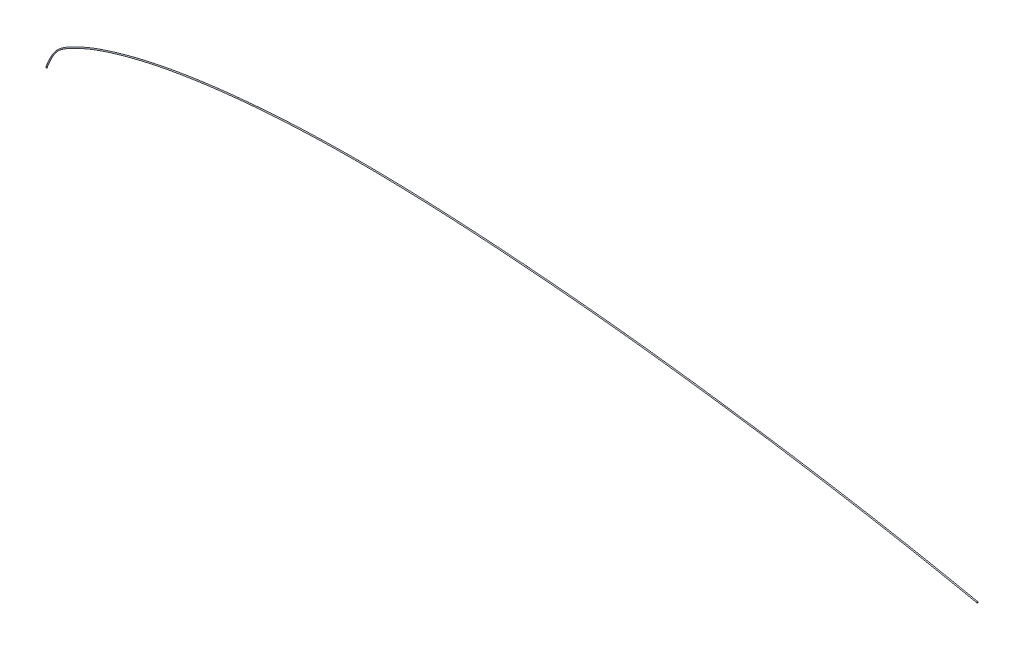
ISO-10303-21;
HEADER;
FILE_DESCRIPTION(('STEP AP214'),'2;1');
FILE_NAME('part.step','',(''),(''),'','','');
FILE_SCHEMA(('AUTOMOTIVE_DESIGN { 1 0 10303 214 1 1 1 1 }'));
ENDSEC;
DATA;
#1=APPLICATION_CONTEXT('core data for automotive mechanical design processes');
#2=APPLICATION_PROTOCOL_DEFINITION('international standard','automotive_design',2000,#1);
#3=PRODUCT_CONTEXT('',#1,'mechanical');
#4=PRODUCT('Part','Part','',(#3));
#5=PRODUCT_RELATED_PRODUCT_CATEGORY('part','',(#4));
#6=PRODUCT_DEFINITION_FORMATION('','',#4);
#7=PRODUCT_DEFINITION_CONTEXT('part definition',#1,'design');
#8=PRODUCT_DEFINITION('design','',#6,#7);
#9=PRODUCT_DEFINITION_SHAPE('','',#8);
#10=(LENGTH_UNIT() NAMED_UNIT(*) SI_UNIT(.MILLI.,.METRE.));
#11=(NAMED_UNIT(*) PLANE_ANGLE_UNIT() SI_UNIT($,.RADIAN.));
#12=(NAMED_UNIT(*) SI_UNIT($,.STERADIAN.) SOLID_ANGLE_UNIT());
#13=UNCERTAINTY_MEASURE_WITH_UNIT(LENGTH_MEASURE(1.E-05),#10,'distance_accuracy_value','');
#14=(GEOMETRIC_REPRESENTATION_CONTEXT(3) GLOBAL_UNCERTAINTY_ASSIGNED_CONTEXT((#13)) GLOBAL_UNIT_ASSIGNED_CONTEXT((#10,
#11,#12)) REPRESENTATION_CONTEXT('',''));
#15=CARTESIAN_POINT('',(0.,0.,0.));
#16=DIRECTION('',(0.,0.,1.));
#17=DIRECTION('',(1.,0.,0.));
#18=AXIS2_PLACEMENT_3D('',#15,#16,#17);
#19=CARTESIAN_POINT('',(821.6356482,1.068126343,0.));
#20=DIRECTION('',(0.981017726503732,0.193918076221502,0.));
#21=DIRECTION('',(0.,0.,1.));
#22=AXIS2_PLACEMENT_3D('',#19,#20,#21);
#23=PLANE('',#22);
#24=CARTESIAN_POINT('',(821.6356482,1.068126343,0.));
#25=DIRECTION('',(0.981017726503732,0.193918076221502,0.));
#26=DIRECTION('',(0.,0.,1.));
#27=AXIS2_PLACEMENT_3D('',#24,#25,#26);
#28=CIRCLE('',#27,0.5);
#29=CARTESIAN_POINT('',(821.6356482,1.068126343,0.5));
#30=VERTEX_POINT('',#29);
#31=EDGE_CURVE('E10',#30,#30,#28,.T.);
#32=ORIENTED_EDGE('',*,*,#31,.T.);
#33=EDGE_LOOP('',(#32));
#34=FACE_BOUND('',#33,.T.);
#35=ADVANCED_FACE('F39',(#34),#23,.T.);
#36=CARTESIAN_POINT('',(821.6356482,1.068126343,0.5));
#37=CARTESIAN_POINT('',(807.949315929663,3.8726429153105,0.5));
#38=CARTESIAN_POINT('',(794.262983662316,6.67715948740843,0.5));
#39=CARTESIAN_POINT('',(739.633161122471,17.3945662259603,0.5));
#40=CARTESIAN_POINT('',(698.520985277327,24.4397528855469,0.5));
#41=CARTESIAN_POINT('',(629.966146484422,35.0385581246609,0.5));
#42=CARTESIAN_POINT('',(602.577080222447,38.959971872981,0.5));
#43=CARTESIAN_POINT('',(547.800671683737,46.1499507530432,0.5));
#44=CARTESIAN_POINT('',(520.413604741873,49.4205662565359,0.5));
#45=CARTESIAN_POINT('',(465.632902318206,55.0828337222342,0.5));
#46=CARTESIAN_POINT('',(438.239542017067,57.4771380091737,0.5));
#47=CARTESIAN_POINT('',(383.4588721508,61.491104774006,0.5));
#48=CARTESIAN_POINT('',(356.071692251463,63.1125277966778,0.5));
#49=CARTESIAN_POINT('',(301.278840028551,65.0611391807135,0.5));
#50=CARTESIAN_POINT('',(273.873260344754,65.3903069812467,0.5));
#51=CARTESIAN_POINT('',(219.050983178815,64.0981242219825,0.5));
#52=CARTESIAN_POINT('',(191.625831459682,62.4953673804491,0.5));
#53=CARTESIAN_POINT('',(150.519756444238,58.2119719363067,0.5));
#54=CARTESIAN_POINT('',(136.746911380907,56.4497204796891,0.5));
#55=CARTESIAN_POINT('',(109.312975276132,52.1023120159522,0.5));
#56=CARTESIAN_POINT('',(95.6523716004522,49.5162650040087,0.5));
#57=CARTESIAN_POINT('',(75.2145134563756,44.5795659214063,0.5));
#58=CARTESIAN_POINT('',(68.3110453118406,42.7226758749477,0.5));
#59=CARTESIAN_POINT('',(54.5715738853773,38.6768513403353,0.5));
#60=CARTESIAN_POINT('',(47.7369220366168,36.48613199558,0.5));
#61=CARTESIAN_POINT('',(36.7868333276846,32.2862239545925,0.5));
#62=CARTESIAN_POINT('',(32.5666487945213,30.4881854096799,0.5));
#63=CARTESIAN_POINT('',(26.304073023569,27.528126593638,0.5));
#64=CARTESIAN_POINT('',(24.2278312714603,26.4976068219342,0.5));
#65=CARTESIAN_POINT('',(20.0905071442538,24.3427443365568,0.5));
#66=CARTESIAN_POINT('',(18.0104542591294,23.2313076901134,0.5));
#67=CARTESIAN_POINT('',(14.0414092535021,20.7837462409737,0.5));
#68=CARTESIAN_POINT('',(12.1591171256037,19.4430632819947,0.5));
#69=CARTESIAN_POINT('',(8.85776861999671,16.3406468875565,0.5));
#70=CARTESIAN_POINT('',(7.44791398536713,14.5716178291864,0.5));
#71=CARTESIAN_POINT('',(3.70331247112468,8.82625416327505,0.5));
#72=CARTESIAN_POINT('',(1.85165623404984,4.41312708300788,0.5));
#73=CARTESIAN_POINT('',(0.,0.,0.5));
#74=CARTESIAN_POINT('',(821.829566276221,0.0871086164962679,0.5));
#75=CARTESIAN_POINT('',(808.143234005109,2.89162518881434,0.5));
#76=CARTESIAN_POINT('',(794.459648892403,5.69667282231044,0.5));
#77=CARTESIAN_POINT('',(739.851664847713,16.4185871723018,0.5));
#78=CARTESIAN_POINT('',(698.751553264622,23.4666318050417,0.5));
#79=CARTESIAN_POINT('',(630.214850913112,34.0699500146192,0.5));
#80=CARTESIAN_POINT('',(602.833163547742,37.9932857265177,0.5));
#81=CARTESIAN_POINT('',(548.071771140847,45.1873680445874,0.5));
#82=CARTESIAN_POINT('',(520.69352836485,48.4604857335446,0.5));
#83=CARTESIAN_POINT('',(465.933037174779,54.1288786757165,0.5));
#84=CARTESIAN_POINT('',(438.54915051956,56.5262278139028,0.5));
#85=CARTESIAN_POINT('',(383.786207048643,60.5461502311617,0.5));
#86=CARTESIAN_POINT('',(356.410871943892,62.1716748057665,0.5));
#87=CARTESIAN_POINT('',(301.647408374213,64.1314059760279,0.5));
#88=CARTESIAN_POINT('',(274.26012686118,64.4678660344989,0.5));
#89=CARTESIAN_POINT('',(219.481209622185,63.195090135347,0.5));
#90=CARTESIAN_POINT('',(192.079130629167,61.6034739262708,0.5));
#91=CARTESIAN_POINT('',(151.013848194414,57.3424218142517,0.5));
#92=CARTESIAN_POINT('',(137.256390445649,55.5890056571223,0.5));
#93=CARTESIAN_POINT('',(109.856416526692,51.2626272355951,0.5));
#94=CARTESIAN_POINT('',(96.2181232764169,48.691016169331,0.5));
#95=CARTESIAN_POINT('',(75.8209381063033,43.7842396370035,0.5));
#96=CARTESIAN_POINT('',(68.9303341859064,41.9373515150608,0.5));
#97=CARTESIAN_POINT('',(55.2155287307647,37.9116224746726,0.5));
#98=CARTESIAN_POINT('',(48.4012159988485,35.7377148490799,0.5));
#99=CARTESIAN_POINT('',(37.4958342417088,31.5805987667842,0.5));
#100=CARTESIAN_POINT('',(33.2933387393552,29.8007404167443,0.5));
#101=CARTESIAN_POINT('',(27.0564967663197,26.8693221955771,0.5));
#102=CARTESIAN_POINT('',(24.9887005302942,25.8485735419041,0.5));
#103=CARTESIAN_POINT('',(20.867856589028,23.7135432015166,0.5));
#104=CARTESIAN_POINT('',(18.7983033095419,22.6138841084808,0.5));
#105=CARTESIAN_POINT('',(14.8802185418365,20.2375622216578,0.5));
#106=CARTESIAN_POINT('',(13.0351612568077,18.952165987822,0.5));
#107=CARTESIAN_POINT('',(9.8085681815603,16.0175158516353,0.5));
#108=CARTESIAN_POINT('',(8.42047072883891,14.3306814336119,0.5));
#109=CARTESIAN_POINT('',(4.7095463844487,8.77002982291899,0.5));
#110=CARTESIAN_POINT('',(2.8516562340514,4.41312708300855,0.5));
#111=CARTESIAN_POINT('',(1.,0.,0.5));
#112=CARTESIAN_POINT('',(821.829566276221,0.0871086164962679,-0.5));
#113=CARTESIAN_POINT('',(808.143234005109,2.89162518881434,-0.5));
#114=CARTESIAN_POINT('',(794.459648892403,5.69667282231044,-0.5));
#115=CARTESIAN_POINT('',(739.851664847713,16.4185871723018,-0.5));
#116=CARTESIAN_POINT('',(698.751553264622,23.4666318050417,-0.5));
#117=CARTESIAN_POINT('',(630.214850913112,34.0699500146192,-0.5));
#118=CARTESIAN_POINT('',(602.833163547742,37.9932857265177,-0.5));
#119=CARTESIAN_POINT('',(548.071771140847,45.1873680445874,-0.5));
#120=CARTESIAN_POINT('',(520.69352836485,48.4604857335446,-0.5));
#121=CARTESIAN_POINT('',(465.933037174779,54.1288786757165,-0.5));
#122=CARTESIAN_POINT('',(438.54915051956,56.5262278139028,-0.5));
#123=CARTESIAN_POINT('',(383.786207048643,60.5461502311617,-0.5));
#124=CARTESIAN_POINT('',(356.410871943892,62.1716748057665,-0.5));
#125=CARTESIAN_POINT('',(301.647408374213,64.1314059760279,-0.5));
#126=CARTESIAN_POINT('',(274.26012686118,64.4678660344989,-0.5));
#127=CARTESIAN_POINT('',(219.481209622185,63.195090135347,-0.5));
#128=CARTESIAN_POINT('',(192.079130629167,61.6034739262708,-0.5));
#129=CARTESIAN_POINT('',(151.013848194414,57.3424218142517,-0.5));
#130=CARTESIAN_POINT('',(137.256390445649,55.5890056571223,-0.5));
#131=CARTESIAN_POINT('',(109.856416526692,51.2626272355951,-0.5));
#132=CARTESIAN_POINT('',(96.2181232764169,48.691016169331,-0.5));
#133=CARTESIAN_POINT('',(75.8209381063033,43.7842396370035,-0.5));
#134=CARTESIAN_POINT('',(68.9303341859064,41.9373515150608,-0.5));
#135=CARTESIAN_POINT('',(55.2155287307647,37.9116224746726,-0.5));
#136=CARTESIAN_POINT('',(48.4012159988485,35.7377148490799,-0.5));
#137=CARTESIAN_POINT('',(37.4958342417088,31.5805987667842,-0.5));
#138=CARTESIAN_POINT('',(33.2933387393552,29.8007404167443,-0.5));
#139=CARTESIAN_POINT('',(27.0564967663197,26.8693221955771,-0.5));
#140=CARTESIAN_POINT('',(24.9887005302942,25.8485735419041,-0.5));
#141=CARTESIAN_POINT('',(20.867856589028,23.7135432015166,-0.5));
#142=CARTESIAN_POINT('',(18.7983033095419,22.6138841084808,-0.5));
#143=CARTESIAN_POINT('',(14.8802185418365,20.2375622216578,-0.5));
#144=CARTESIAN_POINT('',(13.0351612568077,18.952165987822,-0.5));
#145=CARTESIAN_POINT('',(9.8085681815603,16.0175158516353,-0.5));
#146=CARTESIAN_POINT('',(8.42047072883891,14.3306814336119,-0.5));
#147=CARTESIAN_POINT('',(4.7095463844487,8.77002982291899,-0.5));
#148=CARTESIAN_POINT('',(2.8516562340514,4.41312708300855,-0.5));
#149=CARTESIAN_POINT('',(1.,0.,-0.5));
#150=CARTESIAN_POINT('',(821.6356482,1.068126343,-0.5));
#151=CARTESIAN_POINT('',(807.949315929663,3.8726429153105,-0.5));
#152=CARTESIAN_POINT('',(794.262983662316,6.67715948740843,-0.5));
#153=CARTESIAN_POINT('',(739.633161122471,17.3945662259603,-0.5));
#154=CARTESIAN_POINT('',(698.520985277327,24.4397528855469,-0.5));
#155=CARTESIAN_POINT('',(629.966146484422,35.0385581246609,-0.5));
#156=CARTESIAN_POINT('',(602.577080222447,38.959971872981,-0.5));
#157=CARTESIAN_POINT('',(547.800671683737,46.1499507530432,-0.5));
#158=CARTESIAN_POINT('',(520.413604741873,49.4205662565359,-0.5));
#159=CARTESIAN_POINT('',(465.632902318206,55.0828337222342,-0.5));
#160=CARTESIAN_POINT('',(438.239542017067,57.4771380091737,-0.5));
#161=CARTESIAN_POINT('',(383.4588721508,61.491104774006,-0.5));
#162=CARTESIAN_POINT('',(356.071692251463,63.1125277966778,-0.5));
#163=CARTESIAN_POINT('',(301.278840028551,65.0611391807135,-0.5));
#164=CARTESIAN_POINT('',(273.873260344754,65.3903069812467,-0.5));
#165=CARTESIAN_POINT('',(219.050983178815,64.0981242219825,-0.5));
#166=CARTESIAN_POINT('',(191.625831459682,62.4953673804491,-0.5));
#167=CARTESIAN_POINT('',(150.519756444238,58.2119719363067,-0.5));
#168=CARTESIAN_POINT('',(136.746911380907,56.4497204796891,-0.5));
#169=CARTESIAN_POINT('',(109.312975276132,52.1023120159522,-0.5));
#170=CARTESIAN_POINT('',(95.6523716004522,49.5162650040087,-0.5));
#171=CARTESIAN_POINT('',(75.2145134563756,44.5795659214063,-0.5));
#172=CARTESIAN_POINT('',(68.3110453118406,42.7226758749477,-0.5));
#173=CARTESIAN_POINT('',(54.5715738853773,38.6768513403353,-0.5));
#174=CARTESIAN_POINT('',(47.7369220366168,36.48613199558,-0.5));
#175=CARTESIAN_POINT('',(36.7868333276846,32.2862239545925,-0.5));
#176=CARTESIAN_POINT('',(32.5666487945213,30.4881854096799,-0.5));
#177=CARTESIAN_POINT('',(26.304073023569,27.528126593638,-0.5));
#178=CARTESIAN_POINT('',(24.2278312714603,26.4976068219342,-0.5));
#179=CARTESIAN_POINT('',(20.0905071442538,24.3427443365568,-0.5));
#180=CARTESIAN_POINT('',(18.0104542591294,23.2313076901134,-0.5));
#181=CARTESIAN_POINT('',(14.0414092535021,20.7837462409737,-0.5));
#182=CARTESIAN_POINT('',(12.1591171256037,19.4430632819947,-0.5));
#183=CARTESIAN_POINT('',(8.85776861999671,16.3406468875565,-0.5));
#184=CARTESIAN_POINT('',(7.44791398536713,14.5716178291864,-0.5));
#185=CARTESIAN_POINT('',(3.70331247112468,8.82625416327505,-0.5));
#186=CARTESIAN_POINT('',(1.85165623404984,4.41312708300788,-0.5));
#187=CARTESIAN_POINT('',(0.,0.,-0.5));
#188=CARTESIAN_POINT('',(821.441730123778,2.04914406950373,-0.5));
#189=CARTESIAN_POINT('',(807.755397854217,4.85366064180666,-0.5));
#190=CARTESIAN_POINT('',(794.066318432229,7.65764615250642,-0.5));
#191=CARTESIAN_POINT('',(739.414657397228,18.3705452796188,-0.5));
#192=CARTESIAN_POINT('',(698.290417290032,25.4128739660522,-0.5));
#193=CARTESIAN_POINT('',(629.717442055732,36.0071662347027,-0.5));
#194=CARTESIAN_POINT('',(602.320996897153,39.9266580194443,-0.5));
#195=CARTESIAN_POINT('',(547.529572226628,47.1125334614991,-0.5));
#196=CARTESIAN_POINT('',(520.133681118897,50.3806467795272,-0.5));
#197=CARTESIAN_POINT('',(465.332767461632,56.036788768752,-0.5));
#198=CARTESIAN_POINT('',(437.929933514575,58.4280482044446,-0.5));
#199=CARTESIAN_POINT('',(383.131537252957,62.4360593168503,-0.5));
#200=CARTESIAN_POINT('',(355.732512559033,64.053380787589,-0.5));
#201=CARTESIAN_POINT('',(300.910271682889,65.9908723853991,-0.5));
#202=CARTESIAN_POINT('',(273.486393828329,66.3127479279945,-0.5));
#203=CARTESIAN_POINT('',(218.620756735446,65.001158308618,-0.5));
#204=CARTESIAN_POINT('',(191.172532290196,63.3872608346273,-0.5));
#205=CARTESIAN_POINT('',(150.025664694062,59.0815220583617,-0.5));
#206=CARTESIAN_POINT('',(136.237432316164,57.3104353022559,-0.5));
#207=CARTESIAN_POINT('',(108.769534025572,52.9419967963094,-0.5));
#208=CARTESIAN_POINT('',(95.0866199244875,50.3415138386864,-0.5));
#209=CARTESIAN_POINT('',(74.6080888064479,45.3748922058091,-0.5));
#210=CARTESIAN_POINT('',(67.6917564377748,43.5080002348346,-0.5));
#211=CARTESIAN_POINT('',(53.92761903999,39.4420802059979,-0.5));
#212=CARTESIAN_POINT('',(47.0726280743852,37.2345491420799,-0.5));
#213=CARTESIAN_POINT('',(36.0778324136605,32.9918491424008,-0.5));
#214=CARTESIAN_POINT('',(31.8399588496875,31.1756304026156,-0.5));
#215=CARTESIAN_POINT('',(25.5516492808184,28.1869309916988,-0.5));
#216=CARTESIAN_POINT('',(23.4669620126264,27.1466401019643,-0.5));
#217=CARTESIAN_POINT('',(19.3131576994795,24.971945471597,-0.5));
#218=CARTESIAN_POINT('',(17.2226052087169,23.8487312717461,-0.5));
#219=CARTESIAN_POINT('',(13.2025999651678,21.3299302602897,-0.5));
#220=CARTESIAN_POINT('',(11.2830729943998,19.9339605761674,-0.5));
#221=CARTESIAN_POINT('',(7.90696905843312,16.6637779234776,-0.5));
#222=CARTESIAN_POINT('',(6.47535724189535,14.8125542247609,-0.5));
#223=CARTESIAN_POINT('',(2.69707855780067,8.88247850363111,-0.5));
#224=CARTESIAN_POINT('',(0.851656234048288,4.41312708300722,-0.5));
#225=CARTESIAN_POINT('',(-1.,0.,-0.5));
#226=CARTESIAN_POINT('',(821.441730123778,2.04914406950373,0.5));
#227=CARTESIAN_POINT('',(807.755397854217,4.85366064180666,0.5));
#228=CARTESIAN_POINT('',(794.066318432229,7.65764615250642,0.5));
#229=CARTESIAN_POINT('',(739.414657397228,18.3705452796188,0.5));
#230=CARTESIAN_POINT('',(698.290417290032,25.4128739660522,0.5));
#231=CARTESIAN_POINT('',(629.717442055732,36.0071662347027,0.5));
#232=CARTESIAN_POINT('',(602.320996897153,39.9266580194443,0.5));
#233=CARTESIAN_POINT('',(547.529572226628,47.1125334614991,0.5));
#234=CARTESIAN_POINT('',(520.133681118897,50.3806467795272,0.5));
#235=CARTESIAN_POINT('',(465.332767461632,56.036788768752,0.5));
#236=CARTESIAN_POINT('',(437.929933514575,58.4280482044446,0.5));
#237=CARTESIAN_POINT('',(383.131537252957,62.4360593168503,0.5));
#238=CARTESIAN_POINT('',(355.732512559033,64.053380787589,0.5));
#239=CARTESIAN_POINT('',(300.910271682889,65.9908723853991,0.5));
#240=CARTESIAN_POINT('',(273.486393828329,66.3127479279945,0.5));
#241=CARTESIAN_POINT('',(218.620756735446,65.001158308618,0.5));
#242=CARTESIAN_POINT('',(191.172532290196,63.3872608346273,0.5));
#243=CARTESIAN_POINT('',(150.025664694062,59.0815220583617,0.5));
#244=CARTESIAN_POINT('',(136.237432316164,57.3104353022559,0.5));
#245=CARTESIAN_POINT('',(108.769534025572,52.9419967963094,0.5));
#246=CARTESIAN_POINT('',(95.0866199244875,50.3415138386864,0.5));
#247=CARTESIAN_POINT('',(74.6080888064479,45.3748922058091,0.5));
#248=CARTESIAN_POINT('',(67.6917564377748,43.5080002348346,0.5));
#249=CARTESIAN_POINT('',(53.92761903999,39.4420802059979,0.5));
#250=CARTESIAN_POINT('',(47.0726280743852,37.2345491420799,0.5));
#251=CARTESIAN_POINT('',(36.0778324136605,32.9918491424008,0.5));
#252=CARTESIAN_POINT('',(31.8399588496875,31.1756304026156,0.5));
#253=CARTESIAN_POINT('',(25.5516492808184,28.1869309916988,0.5));
#254=CARTESIAN_POINT('',(23.4669620126264,27.1466401019643,0.5));
#255=CARTESIAN_POINT('',(19.3131576994795,24.971945471597,0.5));
#256=CARTESIAN_POINT('',(17.2226052087169,23.8487312717461,0.5));
#257=CARTESIAN_POINT('',(13.2025999651678,21.3299302602897,0.5));
#258=CARTESIAN_POINT('',(11.2830729943998,19.9339605761674,0.5));
#259=CARTESIAN_POINT('',(7.90696905843312,16.6637779234776,0.5));
#260=CARTESIAN_POINT('',(6.47535724189535,14.8125542247609,0.5));
#261=CARTESIAN_POINT('',(2.69707855780067,8.88247850363111,0.5));
#262=CARTESIAN_POINT('',(0.851656234048288,4.41312708300722,0.5));
#263=CARTESIAN_POINT('',(-1.,0.,0.5));
#264=CARTESIAN_POINT('',(821.6356482,1.068126343,0.5));
#265=CARTESIAN_POINT('',(807.949315929663,3.8726429153105,0.5));
#266=CARTESIAN_POINT('',(794.262983662316,6.67715948740843,0.5));
#267=CARTESIAN_POINT('',(739.633161122471,17.3945662259603,0.5));
#268=CARTESIAN_POINT('',(698.520985277327,24.4397528855469,0.5));
#269=CARTESIAN_POINT('',(629.966146484422,35.0385581246609,0.5));
#270=CARTESIAN_POINT('',(602.577080222447,38.959971872981,0.5));
#271=CARTESIAN_POINT('',(547.800671683737,46.1499507530432,0.5));
#272=CARTESIAN_POINT('',(520.413604741873,49.4205662565359,0.5));
#273=CARTESIAN_POINT('',(465.632902318206,55.0828337222342,0.5));
#274=CARTESIAN_POINT('',(438.239542017067,57.4771380091737,0.5));
#275=CARTESIAN_POINT('',(383.4588721508,61.491104774006,0.5));
#276=CARTESIAN_POINT('',(356.071692251463,63.1125277966778,0.5));
#277=CARTESIAN_POINT('',(301.278840028551,65.0611391807135,0.5));
#278=CARTESIAN_POINT('',(273.873260344754,65.3903069812467,0.5));
#279=CARTESIAN_POINT('',(219.050983178815,64.0981242219825,0.5));
#280=CARTESIAN_POINT('',(191.625831459682,62.4953673804491,0.5));
#281=CARTESIAN_POINT('',(150.519756444238,58.2119719363067,0.5));
#282=CARTESIAN_POINT('',(136.746911380907,56.4497204796891,0.5));
#283=CARTESIAN_POINT('',(109.312975276132,52.1023120159522,0.5));
#284=CARTESIAN_POINT('',(95.6523716004522,49.5162650040087,0.5));
#285=CARTESIAN_POINT('',(75.2145134563756,44.5795659214063,0.5));
#286=CARTESIAN_POINT('',(68.3110453118406,42.7226758749477,0.5));
#287=CARTESIAN_POINT('',(54.5715738853773,38.6768513403353,0.5));
#288=CARTESIAN_POINT('',(47.7369220366168,36.48613199558,0.5));
#289=CARTESIAN_POINT('',(36.7868333276846,32.2862239545925,0.5));
#290=CARTESIAN_POINT('',(32.5666487945213,30.4881854096799,0.5));
#291=CARTESIAN_POINT('',(26.304073023569,27.528126593638,0.5));
#292=CARTESIAN_POINT('',(24.2278312714603,26.4976068219342,0.5));
#293=CARTESIAN_POINT('',(20.0905071442538,24.3427443365568,0.5));
#294=CARTESIAN_POINT('',(18.0104542591294,23.2313076901134,0.5));
#295=CARTESIAN_POINT('',(14.0414092535021,20.7837462409737,0.5));
#296=CARTESIAN_POINT('',(12.1591171256037,19.4430632819947,0.5));
#297=CARTESIAN_POINT('',(8.85776861999671,16.3406468875565,0.5));
#298=CARTESIAN_POINT('',(7.44791398536713,14.5716178291864,0.5));
#299=CARTESIAN_POINT('',(3.70331247112468,8.82625416327505,0.5));
#300=CARTESIAN_POINT('',(1.85165623404984,4.41312708300788,0.5));
#301=CARTESIAN_POINT('',(0.,0.,0.5));
#302=(BOUNDED_SURFACE() B_SPLINE_SURFACE(3,3,((#36,#37,#38,#39,#40,#41,#42,#43,#44,#45,#46,#47,
#48,#49,#50,#51,#52,#53,#54,#55,#56,#57,#58,#59,#60,#61,#62,#63,#64,#65,#66,#67,#68,#69,#70,#71,
#72,#73),(#74,#75,#76,#77,#78,#79,#80,#81,#82,#83,#84,#85,#86,#87,#88,#89,#90,#91,#92,#93,#94,
#95,#96,#97,#98,#99,#100,#101,#102,#103,#104,#105,#106,#107,#108,#109,#110,#111),(#112,#113,
#114,#115,#116,#117,#118,#119,#120,#121,#122,#123,#124,#125,#126,#127,#128,#129,#130,#131,#132,
#133,#134,#135,#136,#137,#138,#139,#140,#141,#142,#143,#144,#145,#146,#147,#148,#149),(#150,
#151,#152,#153,#154,#155,#156,#157,#158,#159,#160,#161,#162,#163,#164,#165,#166,#167,#168,#169,
#170,#171,#172,#173,#174,#175,#176,#177,#178,#179,#180,#181,#182,#183,#184,#185,#186,#187),
(#188,#189,#190,#191,#192,#193,#194,#195,#196,#197,#198,#199,#200,#201,#202,#203,#204,#205,#206,
#207,#208,#209,#210,#211,#212,#213,#214,#215,#216,#217,#218,#219,#220,#221,#222,#223,#224,#225),
(#226,#227,#228,#229,#230,#231,#232,#233,#234,#235,#236,#237,#238,#239,#240,#241,#242,#243,#244,
#245,#246,#247,#248,#249,#250,#251,#252,#253,#254,#255,#256,#257,#258,#259,#260,#261,#262,#263),
(#264,#265,#266,#267,#268,#269,#270,#271,#272,#273,#274,#275,#276,#277,#278,#279,#280,#281,#282,
#283,#284,#285,#286,#287,#288,#289,#290,#291,#292,#293,#294,#295,#296,#297,#298,#299,#300,
#301)),.UNSPECIFIED.,.T.,.F.,.F.) B_SPLINE_SURFACE_WITH_KNOTS((4,3,4),(4,2,2,2,2,2,2,2,2,2,2,2,
2,2,2,2,2,2,4),(0.,0.5,1.),(0.,0.0496812988394548,0.197976307914676,0.296362491107645,
0.3944336172207,0.492205408315692,0.589753408139956,0.687151928235106,0.784753711434451,
0.834119584149869,0.883485456865287,0.908917356861565,0.934349256857844,0.950761942643383,
0.958968285536152,0.967174628428922,0.975380971321691,0.983587314214461,1.),
.UNSPECIFIED.) GEOMETRIC_REPRESENTATION_ITEM() RATIONAL_B_SPLINE_SURFACE(((1.,1.,1.,1.,1.,1.,1.,
1.,1.,1.,1.,1.,1.,1.,1.,1.,1.,1.,1.,1.,1.,1.,1.,1.,1.,1.,1.,1.,1.,1.,1.,1.,1.,1.,1.,1.,1.,1.),
(0.333333333333333,0.333333333333333,0.333333333333333,0.333333333333333,0.333333333333333,
0.333333333333333,0.333333333333333,0.333333333333333,0.333333333333333,0.333333333333333,
0.333333333333333,0.333333333333333,0.333333333333333,0.333333333333333,0.333333333333333,
0.333333333333333,0.333333333333333,0.333333333333333,0.333333333333333,0.333333333333333,
0.333333333333333,0.333333333333333,0.333333333333333,0.333333333333333,0.333333333333333,
0.333333333333333,0.333333333333333,0.333333333333333,0.333333333333333,0.333333333333333,
0.333333333333333,0.333333333333333,0.333333333333333,0.333333333333333,0.333333333333333,
0.333333333333333,0.333333333333333,0.333333333333333),(0.333333333333333,0.333333333333333,
0.333333333333333,0.333333333333333,0.333333333333333,0.333333333333333,0.333333333333333,
0.333333333333333,0.333333333333333,0.333333333333333,0.333333333333333,0.333333333333333,
0.333333333333333,0.333333333333333,0.333333333333333,0.333333333333333,0.333333333333333,
0.333333333333333,0.333333333333333,0.333333333333333,0.333333333333333,0.333333333333333,
0.333333333333333,0.333333333333333,0.333333333333333,0.333333333333333,0.333333333333333,
0.333333333333333,0.333333333333333,0.333333333333333,0.333333333333333,0.333333333333333,
0.333333333333333,0.333333333333333,0.333333333333333,0.333333333333333,0.333333333333333,
0.333333333333333),(1.,1.,1.,1.,1.,1.,1.,1.,1.,1.,1.,1.,1.,1.,1.,1.,1.,1.,1.,1.,1.,1.,1.,1.,1.,
1.,1.,1.,1.,1.,1.,1.,1.,1.,1.,1.,1.,1.),(0.333333333333333,0.333333333333333,0.333333333333333,
0.333333333333333,0.333333333333333,0.333333333333333,0.333333333333333,0.333333333333333,
0.333333333333333,0.333333333333333,0.333333333333333,0.333333333333333,0.333333333333333,
0.333333333333333,0.333333333333333,0.333333333333333,0.333333333333333,0.333333333333333,
0.333333333333333,0.333333333333333,0.333333333333333,0.333333333333333,0.333333333333333,
0.333333333333333,0.333333333333333,0.333333333333333,0.333333333333333,0.333333333333333,
0.333333333333333,0.333333333333333,0.333333333333333,0.333333333333333,0.333333333333333,
0.333333333333333,0.333333333333333,0.333333333333333,0.333333333333333,0.333333333333333),
(0.333333333333333,0.333333333333333,0.333333333333333,0.333333333333333,0.333333333333333,
0.333333333333333,0.333333333333333,0.333333333333333,0.333333333333333,0.333333333333333,
0.333333333333333,0.333333333333333,0.333333333333333,0.333333333333333,0.333333333333333,
0.333333333333333,0.333333333333333,0.333333333333333,0.333333333333333,0.333333333333333,
0.333333333333333,0.333333333333333,0.333333333333333,0.333333333333333,0.333333333333333,
0.333333333333333,0.333333333333333,0.333333333333333,0.333333333333333,0.333333333333333,
0.333333333333333,0.333333333333333,0.333333333333333,0.333333333333333,0.333333333333333,
0.333333333333333,0.333333333333333,0.333333333333333),(1.,1.,1.,1.,1.,1.,1.,1.,1.,1.,1.,1.,1.,
1.,1.,1.,1.,1.,1.,1.,1.,1.,1.,1.,1.,1.,1.,1.,1.,1.,1.,1.,1.,1.,1.,1.,1.,1.))) REPRESENTATION_ITEM('') SURFACE());
#303=CARTESIAN_POINT('',(0.,0.,0.));
#304=DIRECTION('',(0.,1.,0.));
#305=DIRECTION('',(0.,0.,1.));
#306=AXIS2_PLACEMENT_3D('',#303,#304,#305);
#307=CIRCLE('',#306,0.5);
#308=CARTESIAN_POINT('',(0.,0.,0.5));
#309=VERTEX_POINT('',#308);
#310=EDGE_CURVE('E49',#309,#309,#307,.T.);
#311=ORIENTED_EDGE('',*,*,#310,.T.);
#312=EDGE_LOOP('',(#311));
#313=FACE_BOUND('',#312,.T.);
#314=ORIENTED_EDGE('',*,*,#31,.F.);
#315=EDGE_LOOP('',(#314));
#316=FACE_BOUND('',#315,.T.);
#317=ADVANCED_FACE('F56',(#313,#316),#302,.F.);
#318=CARTESIAN_POINT('',(0.,-1.,0.));
#319=DIRECTION('',(0.,1.,0.));
#320=DIRECTION('',(0.,0.,1.));
#321=AXIS2_PLACEMENT_3D('',#318,#319,#320);
#322=CYLINDRICAL_SURFACE('',#321,0.5);
#323=CARTESIAN_POINT('',(0.,-1.,0.));
#324=DIRECTION('',(0.,1.,0.));
#325=DIRECTION('',(0.,0.,1.));
#326=AXIS2_PLACEMENT_3D('',#323,#324,#325);
#327=CIRCLE('',#326,0.5);
#328=CARTESIAN_POINT('',(0.,-1.,0.5));
#329=VERTEX_POINT('',#328);
#330=EDGE_CURVE('E45',#329,#329,#327,.T.);
#331=ORIENTED_EDGE('',*,*,#330,.T.);
#332=EDGE_LOOP('',(#331));
#333=FACE_BOUND('',#332,.T.);
#334=ORIENTED_EDGE('',*,*,#310,.F.);
#335=EDGE_LOOP('',(#334));
#336=FACE_BOUND('',#335,.T.);
#337=ADVANCED_FACE('F59',(#333,#336),#322,.T.);
#338=CARTESIAN_POINT('',(0.,-1.,0.));
#339=DIRECTION('',(0.,1.,0.));
#340=DIRECTION('',(0.,0.,1.));
#341=AXIS2_PLACEMENT_3D('',#338,#339,#340);
#342=PLANE('',#341);
#343=ORIENTED_EDGE('',*,*,#330,.F.);
#344=EDGE_LOOP('',(#343));
#345=FACE_BOUND('',#344,.T.);
#346=ADVANCED_FACE('F61',(#345),#342,.F.);
#347=CLOSED_SHELL('',(#35,#317,#337,#346));
#348=MANIFOLD_SOLID_BREP('B2',#347);
#349=ADVANCED_BREP_SHAPE_REPRESENTATION('',(#18,#348),#14);
#350=SHAPE_DEFINITION_REPRESENTATION(#9,#349);
ENDSEC;
END-ISO-10303-21;
